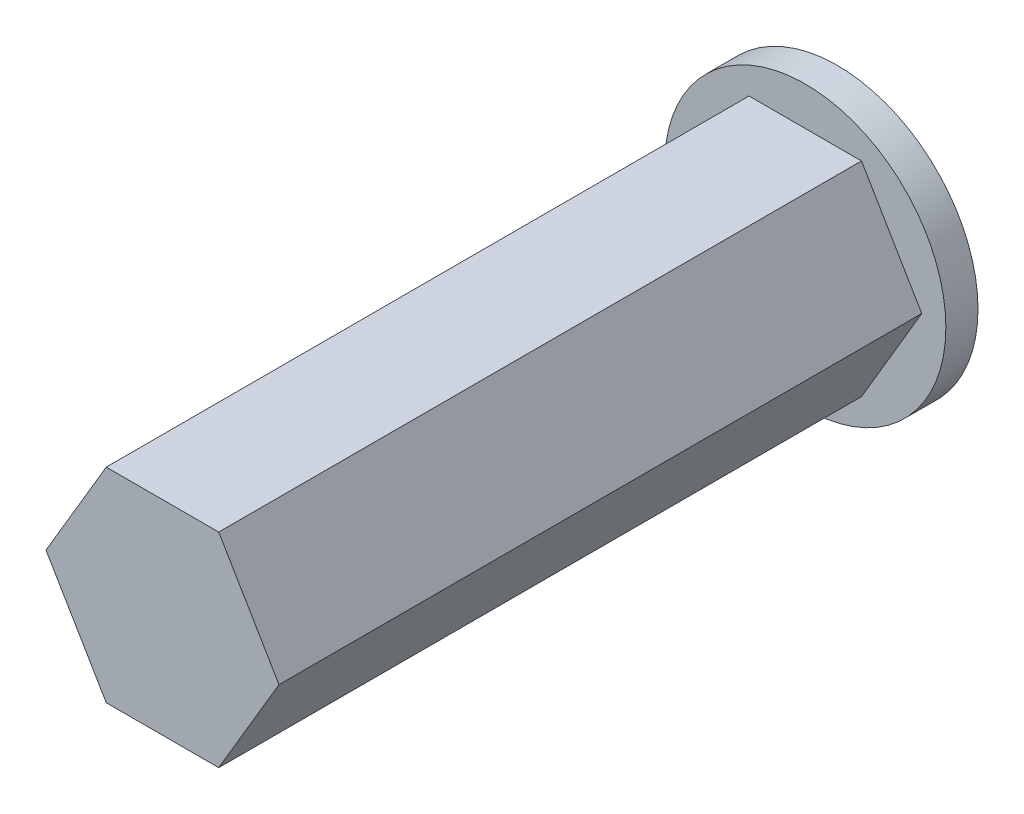
ISO-10303-21;
HEADER;
FILE_DESCRIPTION(('STEP AP214'),'2;1');
FILE_NAME('part.step','',(''),(''),'','','');
FILE_SCHEMA(('AUTOMOTIVE_DESIGN { 1 0 10303 214 1 1 1 1 }'));
ENDSEC;
DATA;
#1=APPLICATION_CONTEXT('core data for automotive mechanical design processes');
#2=APPLICATION_PROTOCOL_DEFINITION('international standard','automotive_design',2000,#1);
#3=PRODUCT_CONTEXT('',#1,'mechanical');
#4=PRODUCT('Part','Part','',(#3));
#5=PRODUCT_RELATED_PRODUCT_CATEGORY('part','',(#4));
#6=PRODUCT_DEFINITION_FORMATION('','',#4);
#7=PRODUCT_DEFINITION_CONTEXT('part definition',#1,'design');
#8=PRODUCT_DEFINITION('design','',#6,#7);
#9=PRODUCT_DEFINITION_SHAPE('','',#8);
#10=(LENGTH_UNIT() NAMED_UNIT(*) SI_UNIT(.MILLI.,.METRE.));
#11=(NAMED_UNIT(*) PLANE_ANGLE_UNIT() SI_UNIT($,.RADIAN.));
#12=(NAMED_UNIT(*) SI_UNIT($,.STERADIAN.) SOLID_ANGLE_UNIT());
#13=UNCERTAINTY_MEASURE_WITH_UNIT(LENGTH_MEASURE(1.E-05),#10,'distance_accuracy_value','');
#14=(GEOMETRIC_REPRESENTATION_CONTEXT(3) GLOBAL_UNCERTAINTY_ASSIGNED_CONTEXT((#13)) GLOBAL_UNIT_ASSIGNED_CONTEXT((#10,
#11,#12)) REPRESENTATION_CONTEXT('',''));
#15=CARTESIAN_POINT('',(0.,0.,0.));
#16=DIRECTION('',(0.,0.,1.));
#17=DIRECTION('',(1.,0.,0.));
#18=AXIS2_PLACEMENT_3D('',#15,#16,#17);
#19=CARTESIAN_POINT('',(0.,0.,2.));
#20=DIRECTION('',(0.,0.,-1.));
#21=DIRECTION('',(-1.,0.,0.));
#22=AXIS2_PLACEMENT_3D('',#19,#20,#21);
#23=CYLINDRICAL_SURFACE('',#22,8.75);
#24=CARTESIAN_POINT('',(0.,0.,2.));
#25=DIRECTION('',(0.,0.,1.));
#26=DIRECTION('',(1.,0.,0.));
#27=AXIS2_PLACEMENT_3D('',#24,#25,#26);
#28=CIRCLE('',#27,8.75);
#29=CARTESIAN_POINT('',(8.75,0.,2.));
#30=VERTEX_POINT('',#29);
#31=EDGE_CURVE('E11',#30,#30,#28,.T.);
#32=ORIENTED_EDGE('',*,*,#31,.F.);
#33=EDGE_LOOP('',(#32));
#34=FACE_BOUND('',#33,.T.);
#35=CARTESIAN_POINT('',(0.,0.,0.));
#36=DIRECTION('',(0.,0.,1.));
#37=DIRECTION('',(1.,0.,0.));
#38=AXIS2_PLACEMENT_3D('',#35,#36,#37);
#39=CIRCLE('',#38,8.75);
#40=CARTESIAN_POINT('',(8.75,0.,0.));
#41=VERTEX_POINT('',#40);
#42=EDGE_CURVE('E39',#41,#41,#39,.T.);
#43=ORIENTED_EDGE('',*,*,#42,.T.);
#44=EDGE_LOOP('',(#43));
#45=FACE_BOUND('',#44,.T.);
#46=ADVANCED_FACE('F36',(#34,#45),#23,.T.);
#47=CARTESIAN_POINT('',(0.,0.,2.));
#48=DIRECTION('',(0.,0.,1.));
#49=DIRECTION('',(1.,0.,0.));
#50=AXIS2_PLACEMENT_3D('',#47,#48,#49);
#51=PLANE('',#50);
#52=DIRECTION('',(0.508500871164439,0.861061475171783,0.));
#53=VECTOR('',#52,1.);
#54=CARTESIAN_POINT('',(3.5,-6.35,2.));
#55=LINE('',#54,#53);
#56=CARTESIAN_POINT('',(3.5,-6.35,2.));
#57=VERTEX_POINT('',#56);
#58=CARTESIAN_POINT('',(7.25,0.,2.));
#59=VERTEX_POINT('',#58);
#60=EDGE_CURVE('E50',#57,#59,#55,.T.);
#61=ORIENTED_EDGE('',*,*,#60,.F.);
#62=DIRECTION('',(1.,0.,0.));
#63=VECTOR('',#62,1.);
#64=CARTESIAN_POINT('',(3.5,-6.35,2.));
#65=LINE('',#64,#63);
#66=CARTESIAN_POINT('',(-3.49999999999999,-6.35,2.));
#67=VERTEX_POINT('',#66);
#68=EDGE_CURVE('E54',#67,#57,#65,.T.);
#69=ORIENTED_EDGE('',*,*,#68,.F.);
#70=DIRECTION('',(0.508500871164439,-0.861061475171782,0.));
#71=VECTOR('',#70,1.);
#72=CARTESIAN_POINT('',(-3.49999999999999,-6.35,2.));
#73=LINE('',#72,#71);
#74=CARTESIAN_POINT('',(-7.25,0.,2.));
#75=VERTEX_POINT('',#74);
#76=EDGE_CURVE('E124',#75,#67,#73,.T.);
#77=ORIENTED_EDGE('',*,*,#76,.F.);
#78=DIRECTION('',(-0.508500871164439,-0.861061475171783,0.));
#79=VECTOR('',#78,1.);
#80=CARTESIAN_POINT('',(-3.5,6.35,2.));
#81=LINE('',#80,#79);
#82=CARTESIAN_POINT('',(-3.5,6.35,2.));
#83=VERTEX_POINT('',#82);
#84=EDGE_CURVE('E126',#83,#75,#81,.T.);
#85=ORIENTED_EDGE('',*,*,#84,.F.);
#86=DIRECTION('',(-1.,0.,0.));
#87=VECTOR('',#86,1.);
#88=CARTESIAN_POINT('',(3.5,6.35,2.));
#89=LINE('',#88,#87);
#90=CARTESIAN_POINT('',(3.5,6.35,2.));
#91=VERTEX_POINT('',#90);
#92=EDGE_CURVE('E129',#91,#83,#89,.T.);
#93=ORIENTED_EDGE('',*,*,#92,.F.);
#94=DIRECTION('',(-0.508500871164439,0.861061475171783,0.));
#95=VECTOR('',#94,1.);
#96=CARTESIAN_POINT('',(3.5,6.35,2.));
#97=LINE('',#96,#95);
#98=EDGE_CURVE('E132',#59,#91,#97,.T.);
#99=ORIENTED_EDGE('',*,*,#98,.F.);
#100=EDGE_LOOP('',(#61,#69,#77,#85,#93,#99));
#101=FACE_BOUND('',#100,.T.);
#102=ORIENTED_EDGE('',*,*,#31,.T.);
#103=EDGE_LOOP('',(#102));
#104=FACE_BOUND('',#103,.T.);
#105=ADVANCED_FACE('F162',(#101,#104),#51,.T.);
#106=CARTESIAN_POINT('',(0.,0.,0.));
#107=DIRECTION('',(0.,0.,1.));
#108=DIRECTION('',(1.,0.,0.));
#109=AXIS2_PLACEMENT_3D('',#106,#107,#108);
#110=PLANE('',#109);
#111=ORIENTED_EDGE('',*,*,#42,.F.);
#112=EDGE_LOOP('',(#111));
#113=FACE_BOUND('',#112,.T.);
#114=ADVANCED_FACE('F167',(#113),#110,.F.);
#115=CARTESIAN_POINT('',(3.5,-6.35,42.));
#116=DIRECTION('',(-0.861061475171783,0.508500871164439,0.));
#117=DIRECTION('',(-0.508500871164439,-0.861061475171783,0.));
#118=AXIS2_PLACEMENT_3D('',#115,#116,#117);
#119=PLANE('',#118);
#120=ORIENTED_EDGE('',*,*,#60,.T.);
#121=DIRECTION('',(0.,0.,-1.));
#122=VECTOR('',#121,1.);
#123=CARTESIAN_POINT('',(7.25,0.,42.));
#124=LINE('',#123,#122);
#125=CARTESIAN_POINT('',(7.25,0.,42.));
#126=VERTEX_POINT('',#125);
#127=EDGE_CURVE('E91',#126,#59,#124,.T.);
#128=ORIENTED_EDGE('',*,*,#127,.F.);
#129=DIRECTION('',(0.508500871164439,0.861061475171783,0.));
#130=VECTOR('',#129,1.);
#131=CARTESIAN_POINT('',(3.5,-6.35,42.));
#132=LINE('',#131,#130);
#133=CARTESIAN_POINT('',(3.5,-6.35,42.));
#134=VERTEX_POINT('',#133);
#135=EDGE_CURVE('E97',#134,#126,#132,.T.);
#136=ORIENTED_EDGE('',*,*,#135,.F.);
#137=DIRECTION('',(0.,0.,-1.));
#138=VECTOR('',#137,1.);
#139=CARTESIAN_POINT('',(3.5,-6.35,42.));
#140=LINE('',#139,#138);
#141=EDGE_CURVE('E121',#134,#57,#140,.T.);
#142=ORIENTED_EDGE('',*,*,#141,.T.);
#143=EDGE_LOOP('',(#120,#128,#136,#142));
#144=FACE_BOUND('',#143,.T.);
#145=ADVANCED_FACE('F107',(#144),#119,.F.);
#146=CARTESIAN_POINT('',(3.5,6.35,42.));
#147=DIRECTION('',(-0.861061475171783,-0.508500871164439,0.));
#148=DIRECTION('',(0.508500871164439,-0.861061475171783,0.));
#149=AXIS2_PLACEMENT_3D('',#146,#147,#148);
#150=PLANE('',#149);
#151=ORIENTED_EDGE('',*,*,#98,.T.);
#152=DIRECTION('',(0.,0.,-1.));
#153=VECTOR('',#152,1.);
#154=CARTESIAN_POINT('',(3.5,6.35,42.));
#155=LINE('',#154,#153);
#156=CARTESIAN_POINT('',(3.5,6.35,42.));
#157=VERTEX_POINT('',#156);
#158=EDGE_CURVE('E93',#157,#91,#155,.T.);
#159=ORIENTED_EDGE('',*,*,#158,.F.);
#160=DIRECTION('',(-0.508500871164439,0.861061475171783,0.));
#161=VECTOR('',#160,1.);
#162=CARTESIAN_POINT('',(3.5,6.35,42.));
#163=LINE('',#162,#161);
#164=EDGE_CURVE('E86',#126,#157,#163,.T.);
#165=ORIENTED_EDGE('',*,*,#164,.F.);
#166=ORIENTED_EDGE('',*,*,#127,.T.);
#167=EDGE_LOOP('',(#151,#159,#165,#166));
#168=FACE_BOUND('',#167,.T.);
#169=ADVANCED_FACE('F89',(#168),#150,.F.);
#170=CARTESIAN_POINT('',(3.5,6.35,42.));
#171=DIRECTION('',(0.,-1.,0.));
#172=DIRECTION('',(0.,0.,-1.));
#173=AXIS2_PLACEMENT_3D('',#170,#171,#172);
#174=PLANE('',#173);
#175=ORIENTED_EDGE('',*,*,#92,.T.);
#176=DIRECTION('',(0.,0.,-1.));
#177=VECTOR('',#176,1.);
#178=CARTESIAN_POINT('',(-3.5,6.35,42.));
#179=LINE('',#178,#177);
#180=CARTESIAN_POINT('',(-3.5,6.35,42.));
#181=VERTEX_POINT('',#180);
#182=EDGE_CURVE('E110',#181,#83,#179,.T.);
#183=ORIENTED_EDGE('',*,*,#182,.F.);
#184=DIRECTION('',(-1.,0.,0.));
#185=VECTOR('',#184,1.);
#186=CARTESIAN_POINT('',(3.5,6.35,42.));
#187=LINE('',#186,#185);
#188=EDGE_CURVE('E96',#157,#181,#187,.T.);
#189=ORIENTED_EDGE('',*,*,#188,.F.);
#190=ORIENTED_EDGE('',*,*,#158,.T.);
#191=EDGE_LOOP('',(#175,#183,#189,#190));
#192=FACE_BOUND('',#191,.T.);
#193=ADVANCED_FACE('F144',(#192),#174,.F.);
#194=CARTESIAN_POINT('',(-3.5,6.35,42.));
#195=DIRECTION('',(0.861061475171783,-0.508500871164439,0.));
#196=DIRECTION('',(0.508500871164439,0.861061475171783,0.));
#197=AXIS2_PLACEMENT_3D('',#194,#195,#196);
#198=PLANE('',#197);
#199=ORIENTED_EDGE('',*,*,#84,.T.);
#200=DIRECTION('',(0.,0.,-1.));
#201=VECTOR('',#200,1.);
#202=CARTESIAN_POINT('',(-7.25,0.,42.));
#203=LINE('',#202,#201);
#204=CARTESIAN_POINT('',(-7.25,0.,42.));
#205=VERTEX_POINT('',#204);
#206=EDGE_CURVE('E115',#205,#75,#203,.T.);
#207=ORIENTED_EDGE('',*,*,#206,.F.);
#208=DIRECTION('',(-0.508500871164439,-0.861061475171783,0.));
#209=VECTOR('',#208,1.);
#210=CARTESIAN_POINT('',(-3.5,6.35,42.));
#211=LINE('',#210,#209);
#212=EDGE_CURVE('E138',#181,#205,#211,.T.);
#213=ORIENTED_EDGE('',*,*,#212,.F.);
#214=ORIENTED_EDGE('',*,*,#182,.T.);
#215=EDGE_LOOP('',(#199,#207,#213,#214));
#216=FACE_BOUND('',#215,.T.);
#217=ADVANCED_FACE('F146',(#216),#198,.F.);
#218=CARTESIAN_POINT('',(-3.49999999999999,-6.35,42.));
#219=DIRECTION('',(0.861061475171782,0.508500871164439,0.));
#220=DIRECTION('',(-0.508500871164439,0.861061475171782,0.));
#221=AXIS2_PLACEMENT_3D('',#218,#219,#220);
#222=PLANE('',#221);
#223=ORIENTED_EDGE('',*,*,#76,.T.);
#224=DIRECTION('',(0.,0.,-1.));
#225=VECTOR('',#224,1.);
#226=CARTESIAN_POINT('',(-3.49999999999999,-6.35,42.));
#227=LINE('',#226,#225);
#228=CARTESIAN_POINT('',(-3.49999999999999,-6.35,42.));
#229=VERTEX_POINT('',#228);
#230=EDGE_CURVE('E118',#229,#67,#227,.T.);
#231=ORIENTED_EDGE('',*,*,#230,.F.);
#232=DIRECTION('',(0.508500871164439,-0.861061475171782,0.));
#233=VECTOR('',#232,1.);
#234=CARTESIAN_POINT('',(-3.49999999999999,-6.35,42.));
#235=LINE('',#234,#233);
#236=EDGE_CURVE('E136',#205,#229,#235,.T.);
#237=ORIENTED_EDGE('',*,*,#236,.F.);
#238=ORIENTED_EDGE('',*,*,#206,.T.);
#239=EDGE_LOOP('',(#223,#231,#237,#238));
#240=FACE_BOUND('',#239,.T.);
#241=ADVANCED_FACE('F150',(#240),#222,.F.);
#242=CARTESIAN_POINT('',(3.5,-6.35,42.));
#243=DIRECTION('',(0.,1.,0.));
#244=DIRECTION('',(0.,0.,1.));
#245=AXIS2_PLACEMENT_3D('',#242,#243,#244);
#246=PLANE('',#245);
#247=ORIENTED_EDGE('',*,*,#68,.T.);
#248=ORIENTED_EDGE('',*,*,#141,.F.);
#249=DIRECTION('',(1.,0.,0.));
#250=VECTOR('',#249,1.);
#251=CARTESIAN_POINT('',(3.5,-6.35,42.));
#252=LINE('',#251,#250);
#253=EDGE_CURVE('E102',#229,#134,#252,.T.);
#254=ORIENTED_EDGE('',*,*,#253,.F.);
#255=ORIENTED_EDGE('',*,*,#230,.T.);
#256=EDGE_LOOP('',(#247,#248,#254,#255));
#257=FACE_BOUND('',#256,.T.);
#258=ADVANCED_FACE('F152',(#257),#246,.F.);
#259=CARTESIAN_POINT('',(0.,0.,42.));
#260=DIRECTION('',(0.,0.,-1.));
#261=DIRECTION('',(-1.,0.,0.));
#262=AXIS2_PLACEMENT_3D('',#259,#260,#261);
#263=PLANE('',#262);
#264=ORIENTED_EDGE('',*,*,#135,.T.);
#265=ORIENTED_EDGE('',*,*,#164,.T.);
#266=ORIENTED_EDGE('',*,*,#188,.T.);
#267=ORIENTED_EDGE('',*,*,#212,.T.);
#268=ORIENTED_EDGE('',*,*,#236,.T.);
#269=ORIENTED_EDGE('',*,*,#253,.T.);
#270=EDGE_LOOP('',(#264,#265,#266,#267,#268,#269));
#271=FACE_BOUND('',#270,.T.);
#272=ADVANCED_FACE('F100',(#271),#263,.F.);
#273=CLOSED_SHELL('',(#46,#105,#114,#145,#169,#193,#217,#241,#258,#272));
#274=MANIFOLD_SOLID_BREP('B2',#273);
#275=ADVANCED_BREP_SHAPE_REPRESENTATION('',(#18,#274),#14);
#276=SHAPE_DEFINITION_REPRESENTATION(#9,#275);
ENDSEC;
END-ISO-10303-21;
